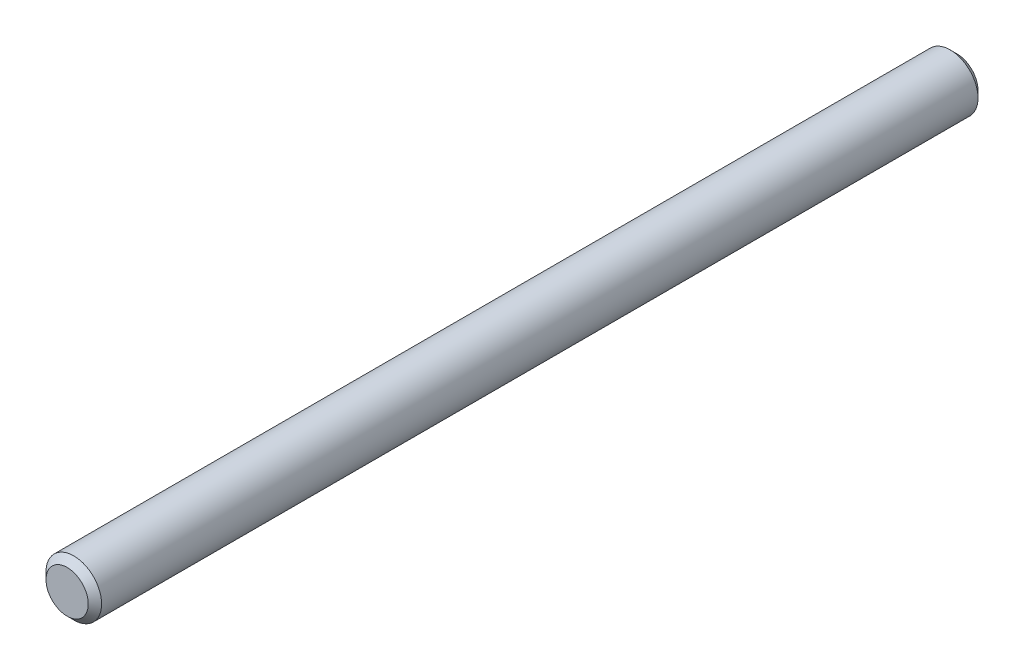
ISO-10303-21;
HEADER;
FILE_DESCRIPTION(('STEP AP214'),'2;1');
FILE_NAME('part.step','',(''),(''),'','','');
FILE_SCHEMA(('AUTOMOTIVE_DESIGN { 1 0 10303 214 1 1 1 1 }'));
ENDSEC;
DATA;
#1=APPLICATION_CONTEXT('core data for automotive mechanical design processes');
#2=APPLICATION_PROTOCOL_DEFINITION('international standard','automotive_design',2000,#1);
#3=PRODUCT_CONTEXT('',#1,'mechanical');
#4=PRODUCT('Part','Part','',(#3));
#5=PRODUCT_RELATED_PRODUCT_CATEGORY('part','',(#4));
#6=PRODUCT_DEFINITION_FORMATION('','',#4);
#7=PRODUCT_DEFINITION_CONTEXT('part definition',#1,'design');
#8=PRODUCT_DEFINITION('design','',#6,#7);
#9=PRODUCT_DEFINITION_SHAPE('','',#8);
#10=(LENGTH_UNIT() NAMED_UNIT(*) SI_UNIT(.MILLI.,.METRE.));
#11=(NAMED_UNIT(*) PLANE_ANGLE_UNIT() SI_UNIT($,.RADIAN.));
#12=(NAMED_UNIT(*) SI_UNIT($,.STERADIAN.) SOLID_ANGLE_UNIT());
#13=UNCERTAINTY_MEASURE_WITH_UNIT(LENGTH_MEASURE(1.E-05),#10,'distance_accuracy_value','');
#14=(GEOMETRIC_REPRESENTATION_CONTEXT(3) GLOBAL_UNCERTAINTY_ASSIGNED_CONTEXT((#13)) GLOBAL_UNIT_ASSIGNED_CONTEXT((#10,
#11,#12)) REPRESENTATION_CONTEXT('',''));
#15=CARTESIAN_POINT('',(0.,0.,0.));
#16=DIRECTION('',(0.,0.,1.));
#17=DIRECTION('',(1.,0.,0.));
#18=AXIS2_PLACEMENT_3D('',#15,#16,#17);
#19=CARTESIAN_POINT('',(0.,0.,101.6));
#20=DIRECTION('',(0.,0.,-1.));
#21=DIRECTION('',(-1.,0.,0.));
#22=AXIS2_PLACEMENT_3D('',#19,#20,#21);
#23=CYLINDRICAL_SURFACE('',#22,3.175);
#24=CARTESIAN_POINT('',(0.,0.,0.761999999999999));
#25=DIRECTION('',(0.,0.,1.));
#26=DIRECTION('',(1.,0.,0.));
#27=AXIS2_PLACEMENT_3D('',#24,#25,#26);
#28=CIRCLE('',#27,3.175);
#29=CARTESIAN_POINT('',(3.175,0.,0.761999999999999));
#30=VERTEX_POINT('',#29);
#31=EDGE_CURVE('E44',#30,#30,#28,.T.);
#32=ORIENTED_EDGE('',*,*,#31,.T.);
#33=EDGE_LOOP('',(#32));
#34=FACE_BOUND('',#33,.T.);
#35=CARTESIAN_POINT('',(0.,0.,100.838));
#36=DIRECTION('',(0.,0.,1.));
#37=DIRECTION('',(1.,0.,0.));
#38=AXIS2_PLACEMENT_3D('',#35,#36,#37);
#39=CIRCLE('',#38,3.175);
#40=CARTESIAN_POINT('',(3.175,0.,100.838));
#41=VERTEX_POINT('',#40);
#42=EDGE_CURVE('E48',#41,#41,#39,.F.);
#43=ORIENTED_EDGE('',*,*,#42,.T.);
#44=EDGE_LOOP('',(#43));
#45=FACE_BOUND('',#44,.T.);
#46=ADVANCED_FACE('F33',(#34,#45),#23,.T.);
#47=CARTESIAN_POINT('',(0.,0.,101.6));
#48=DIRECTION('',(0.,0.,1.));
#49=DIRECTION('',(1.,0.,0.));
#50=AXIS2_PLACEMENT_3D('',#47,#48,#49);
#51=PLANE('',#50);
#52=CARTESIAN_POINT('',(0.,0.,101.6));
#53=DIRECTION('',(0.,0.,1.));
#54=DIRECTION('',(1.,0.,0.));
#55=AXIS2_PLACEMENT_3D('',#52,#53,#54);
#56=CIRCLE('',#55,2.41300000000001);
#57=CARTESIAN_POINT('',(2.41300000000001,0.,101.6));
#58=VERTEX_POINT('',#57);
#59=EDGE_CURVE('E10',#58,#58,#56,.T.);
#60=ORIENTED_EDGE('',*,*,#59,.T.);
#61=EDGE_LOOP('',(#60));
#62=FACE_BOUND('',#61,.T.);
#63=ADVANCED_FACE('F64',(#62),#51,.T.);
#64=CARTESIAN_POINT('',(0.,0.,0.));
#65=DIRECTION('',(0.,0.,1.));
#66=DIRECTION('',(1.,0.,0.));
#67=AXIS2_PLACEMENT_3D('',#64,#65,#66);
#68=PLANE('',#67);
#69=CARTESIAN_POINT('',(0.,0.,0.));
#70=DIRECTION('',(0.,0.,1.));
#71=DIRECTION('',(1.,0.,0.));
#72=AXIS2_PLACEMENT_3D('',#69,#70,#71);
#73=CIRCLE('',#72,2.413);
#74=CARTESIAN_POINT('',(2.413,0.,0.));
#75=VERTEX_POINT('',#74);
#76=EDGE_CURVE('E40',#75,#75,#73,.F.);
#77=ORIENTED_EDGE('',*,*,#76,.T.);
#78=EDGE_LOOP('',(#77));
#79=FACE_BOUND('',#78,.T.);
#80=ADVANCED_FACE('F61',(#79),#68,.F.);
#81=CARTESIAN_POINT('',(0.,0.,0.761999999999999));
#82=DIRECTION('',(0.,0.,1.));
#83=DIRECTION('',(1.,0.,0.));
#84=AXIS2_PLACEMENT_3D('',#81,#82,#83);
#85=CONICAL_SURFACE('',#84,3.175,0.78539816339745);
#86=ORIENTED_EDGE('',*,*,#76,.F.);
#87=EDGE_LOOP('',(#86));
#88=FACE_BOUND('',#87,.T.);
#89=ORIENTED_EDGE('',*,*,#31,.F.);
#90=EDGE_LOOP('',(#89));
#91=FACE_BOUND('',#90,.T.);
#92=ADVANCED_FACE('F57',(#88,#91),#85,.T.);
#93=CARTESIAN_POINT('',(0.,0.,101.6));
#94=DIRECTION('',(0.,0.,-1.));
#95=DIRECTION('',(-1.,0.,0.));
#96=AXIS2_PLACEMENT_3D('',#93,#94,#95);
#97=CONICAL_SURFACE('',#96,2.41300000000001,0.78539816339745);
#98=ORIENTED_EDGE('',*,*,#42,.F.);
#99=EDGE_LOOP('',(#98));
#100=FACE_BOUND('',#99,.T.);
#101=ORIENTED_EDGE('',*,*,#59,.F.);
#102=EDGE_LOOP('',(#101));
#103=FACE_BOUND('',#102,.T.);
#104=ADVANCED_FACE('F35',(#100,#103),#97,.T.);
#105=CLOSED_SHELL('',(#46,#63,#80,#92,#104));
#106=MANIFOLD_SOLID_BREP('B2',#105);
#107=ADVANCED_BREP_SHAPE_REPRESENTATION('',(#18,#106),#14);
#108=SHAPE_DEFINITION_REPRESENTATION(#9,#107);
ENDSEC;
END-ISO-10303-21;
